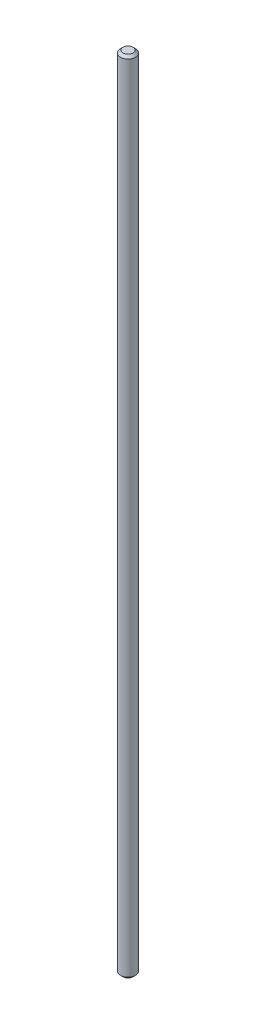
ISO-10303-21;
HEADER;
FILE_DESCRIPTION(('STEP AP214'),'2;1');
FILE_NAME('part.step','',(''),(''),'','','');
FILE_SCHEMA(('AUTOMOTIVE_DESIGN { 1 0 10303 214 1 1 1 1 }'));
ENDSEC;
DATA;
#1=APPLICATION_CONTEXT('core data for automotive mechanical design processes');
#2=APPLICATION_PROTOCOL_DEFINITION('international standard','automotive_design',2000,#1);
#3=PRODUCT_CONTEXT('',#1,'mechanical');
#4=PRODUCT('Part','Part','',(#3));
#5=PRODUCT_RELATED_PRODUCT_CATEGORY('part','',(#4));
#6=PRODUCT_DEFINITION_FORMATION('','',#4);
#7=PRODUCT_DEFINITION_CONTEXT('part definition',#1,'design');
#8=PRODUCT_DEFINITION('design','',#6,#7);
#9=PRODUCT_DEFINITION_SHAPE('','',#8);
#10=(LENGTH_UNIT() NAMED_UNIT(*) SI_UNIT(.MILLI.,.METRE.));
#11=(NAMED_UNIT(*) PLANE_ANGLE_UNIT() SI_UNIT($,.RADIAN.));
#12=(NAMED_UNIT(*) SI_UNIT($,.STERADIAN.) SOLID_ANGLE_UNIT());
#13=UNCERTAINTY_MEASURE_WITH_UNIT(LENGTH_MEASURE(1.E-05),#10,'distance_accuracy_value','');
#14=(GEOMETRIC_REPRESENTATION_CONTEXT(3) GLOBAL_UNCERTAINTY_ASSIGNED_CONTEXT((#13)) GLOBAL_UNIT_ASSIGNED_CONTEXT((#10,
#11,#12)) REPRESENTATION_CONTEXT('',''));
#15=CARTESIAN_POINT('',(0.,0.,0.));
#16=DIRECTION('',(0.,0.,1.));
#17=DIRECTION('',(1.,0.,0.));
#18=AXIS2_PLACEMENT_3D('',#15,#16,#17);
#19=CARTESIAN_POINT('',(0.,320.,0.));
#20=DIRECTION('',(0.,-1.,0.));
#21=DIRECTION('',(0.,0.,-1.));
#22=AXIS2_PLACEMENT_3D('',#19,#20,#21);
#23=CYLINDRICAL_SURFACE('',#22,3.);
#24=CARTESIAN_POINT('',(0.,1.00000000000006,0.));
#25=DIRECTION('',(0.,1.,0.));
#26=DIRECTION('',(0.,0.,1.));
#27=AXIS2_PLACEMENT_3D('',#24,#25,#26);
#28=CIRCLE('',#27,3.);
#29=CARTESIAN_POINT('',(0.,1.00000000000006,3.));
#30=VERTEX_POINT('',#29);
#31=EDGE_CURVE('E40',#30,#30,#28,.T.);
#32=ORIENTED_EDGE('',*,*,#31,.T.);
#33=EDGE_LOOP('',(#32));
#34=FACE_BOUND('',#33,.T.);
#35=CARTESIAN_POINT('',(0.,319.,0.));
#36=DIRECTION('',(0.,1.,0.));
#37=DIRECTION('',(0.,0.,1.));
#38=AXIS2_PLACEMENT_3D('',#35,#36,#37);
#39=CIRCLE('',#38,3.);
#40=CARTESIAN_POINT('',(0.,319.,3.));
#41=VERTEX_POINT('',#40);
#42=EDGE_CURVE('E44',#41,#41,#39,.F.);
#43=ORIENTED_EDGE('',*,*,#42,.T.);
#44=EDGE_LOOP('',(#43));
#45=FACE_BOUND('',#44,.T.);
#46=ADVANCED_FACE('F33',(#34,#45),#23,.T.);
#47=CARTESIAN_POINT('',(0.,320.,0.));
#48=DIRECTION('',(0.,1.,0.));
#49=DIRECTION('',(0.,0.,1.));
#50=AXIS2_PLACEMENT_3D('',#47,#48,#49);
#51=PLANE('',#50);
#52=CARTESIAN_POINT('',(0.,320.,0.));
#53=DIRECTION('',(0.,1.,0.));
#54=DIRECTION('',(0.,0.,1.));
#55=AXIS2_PLACEMENT_3D('',#52,#53,#54);
#56=CIRCLE('',#55,2.);
#57=CARTESIAN_POINT('',(0.,320.,2.));
#58=VERTEX_POINT('',#57);
#59=EDGE_CURVE('E48',#58,#58,#56,.T.);
#60=ORIENTED_EDGE('',*,*,#59,.T.);
#61=EDGE_LOOP('',(#60));
#62=FACE_BOUND('',#61,.T.);
#63=ADVANCED_FACE('F54',(#62),#51,.T.);
#64=CARTESIAN_POINT('',(0.,0.,0.));
#65=DIRECTION('',(0.,1.,0.));
#66=DIRECTION('',(0.,0.,1.));
#67=AXIS2_PLACEMENT_3D('',#64,#65,#66);
#68=PLANE('',#67);
#69=CARTESIAN_POINT('',(0.,0.,0.));
#70=DIRECTION('',(0.,1.,0.));
#71=DIRECTION('',(0.,0.,1.));
#72=AXIS2_PLACEMENT_3D('',#69,#70,#71);
#73=CIRCLE('',#72,1.99999999999992);
#74=CARTESIAN_POINT('',(0.,0.,1.99999999999992));
#75=VERTEX_POINT('',#74);
#76=EDGE_CURVE('E10',#75,#75,#73,.F.);
#77=ORIENTED_EDGE('',*,*,#76,.T.);
#78=EDGE_LOOP('',(#77));
#79=FACE_BOUND('',#78,.T.);
#80=ADVANCED_FACE('F58',(#79),#68,.F.);
#81=CARTESIAN_POINT('',(0.,320.,0.));
#82=DIRECTION('',(0.,-1.,0.));
#83=DIRECTION('',(0.,0.,-1.));
#84=AXIS2_PLACEMENT_3D('',#81,#82,#83);
#85=CONICAL_SURFACE('',#84,2.,0.78539816339742);
#86=ORIENTED_EDGE('',*,*,#42,.F.);
#87=EDGE_LOOP('',(#86));
#88=FACE_BOUND('',#87,.T.);
#89=ORIENTED_EDGE('',*,*,#59,.F.);
#90=EDGE_LOOP('',(#89));
#91=FACE_BOUND('',#90,.T.);
#92=ADVANCED_FACE('F56',(#88,#91),#85,.T.);
#93=CARTESIAN_POINT('',(0.,1.00000000000006,0.));
#94=DIRECTION('',(0.,1.,0.));
#95=DIRECTION('',(0.,0.,1.));
#96=AXIS2_PLACEMENT_3D('',#93,#94,#95);
#97=CONICAL_SURFACE('',#96,3.,0.785398163397461);
#98=ORIENTED_EDGE('',*,*,#76,.F.);
#99=EDGE_LOOP('',(#98));
#100=FACE_BOUND('',#99,.T.);
#101=ORIENTED_EDGE('',*,*,#31,.F.);
#102=EDGE_LOOP('',(#101));
#103=FACE_BOUND('',#102,.T.);
#104=ADVANCED_FACE('F35',(#100,#103),#97,.T.);
#105=CLOSED_SHELL('',(#46,#63,#80,#92,#104));
#106=MANIFOLD_SOLID_BREP('B2',#105);
#107=ADVANCED_BREP_SHAPE_REPRESENTATION('',(#18,#106),#14);
#108=SHAPE_DEFINITION_REPRESENTATION(#9,#107);
ENDSEC;
END-ISO-10303-21;
